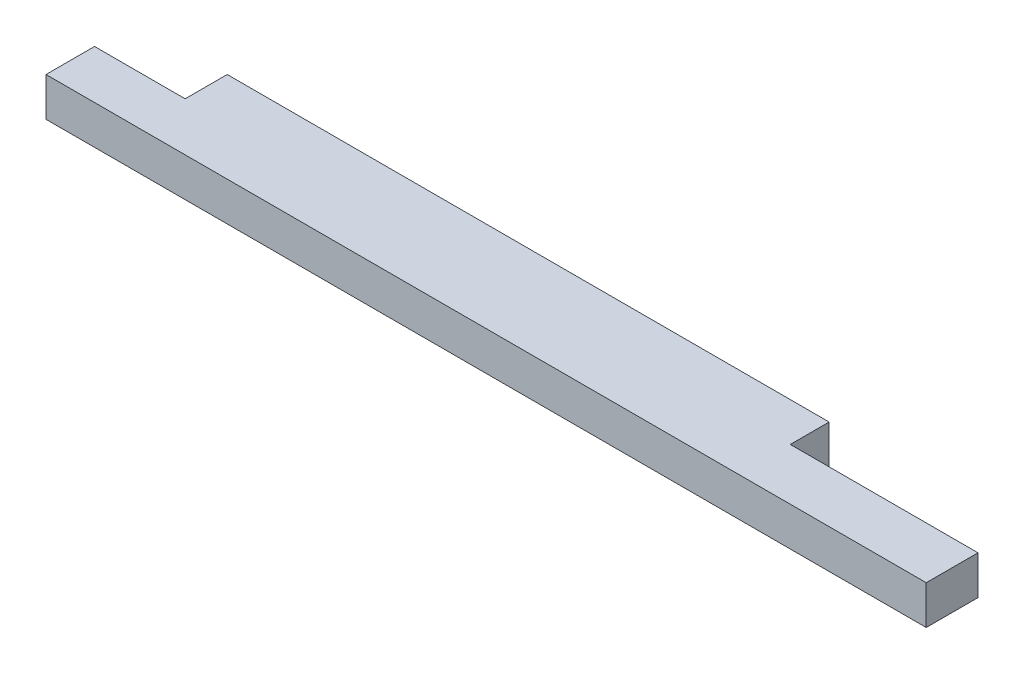
ISO-10303-21;
HEADER;
FILE_DESCRIPTION(('STEP AP214'),'2;1');
FILE_NAME('part.step','',(''),(''),'','','');
FILE_SCHEMA(('AUTOMOTIVE_DESIGN { 1 0 10303 214 1 1 1 1 }'));
ENDSEC;
DATA;
#1=APPLICATION_CONTEXT('core data for automotive mechanical design processes');
#2=APPLICATION_PROTOCOL_DEFINITION('international standard','automotive_design',2000,#1);
#3=PRODUCT_CONTEXT('',#1,'mechanical');
#4=PRODUCT('Part','Part','',(#3));
#5=PRODUCT_RELATED_PRODUCT_CATEGORY('part','',(#4));
#6=PRODUCT_DEFINITION_FORMATION('','',#4);
#7=PRODUCT_DEFINITION_CONTEXT('part definition',#1,'design');
#8=PRODUCT_DEFINITION('design','',#6,#7);
#9=PRODUCT_DEFINITION_SHAPE('','',#8);
#10=(LENGTH_UNIT() NAMED_UNIT(*) SI_UNIT(.MILLI.,.METRE.));
#11=(NAMED_UNIT(*) PLANE_ANGLE_UNIT() SI_UNIT($,.RADIAN.));
#12=(NAMED_UNIT(*) SI_UNIT($,.STERADIAN.) SOLID_ANGLE_UNIT());
#13=UNCERTAINTY_MEASURE_WITH_UNIT(LENGTH_MEASURE(1.E-05),#10,'distance_accuracy_value','');
#14=(GEOMETRIC_REPRESENTATION_CONTEXT(3) GLOBAL_UNCERTAINTY_ASSIGNED_CONTEXT((#13)) GLOBAL_UNIT_ASSIGNED_CONTEXT((#10,
#11,#12)) REPRESENTATION_CONTEXT('',''));
#15=CARTESIAN_POINT('',(0.,0.,0.));
#16=DIRECTION('',(0.,0.,1.));
#17=DIRECTION('',(1.,0.,0.));
#18=AXIS2_PLACEMENT_3D('',#15,#16,#17);
#19=CARTESIAN_POINT('',(0.,38.1,0.));
#20=DIRECTION('',(1.,0.,0.));
#21=DIRECTION('',(0.,0.,-1.));
#22=AXIS2_PLACEMENT_3D('',#19,#20,#21);
#23=PLANE('',#22);
#24=DIRECTION('',(0.,0.,1.));
#25=VECTOR('',#24,1.);
#26=CARTESIAN_POINT('',(0.,38.1,0.));
#27=LINE('',#26,#25);
#28=CARTESIAN_POINT('',(0.,38.1,-47.625));
#29=VERTEX_POINT('',#28);
#30=CARTESIAN_POINT('',(0.,38.1,0.));
#31=VERTEX_POINT('',#30);
#32=EDGE_CURVE('E117',#29,#31,#27,.T.);
#33=ORIENTED_EDGE('',*,*,#32,.F.);
#34=DIRECTION('',(0.,1.,0.));
#35=VECTOR('',#34,1.);
#36=CARTESIAN_POINT('',(0.,0.,-47.625));
#37=LINE('',#36,#35);
#38=CARTESIAN_POINT('',(0.,0.,-47.625));
#39=VERTEX_POINT('',#38);
#40=EDGE_CURVE('E105',#39,#29,#37,.T.);
#41=ORIENTED_EDGE('',*,*,#40,.F.);
#42=DIRECTION('',(0.,0.,1.));
#43=VECTOR('',#42,1.);
#44=CARTESIAN_POINT('',(0.,0.,0.));
#45=LINE('',#44,#43);
#46=CARTESIAN_POINT('',(0.,0.,0.));
#47=VERTEX_POINT('',#46);
#48=EDGE_CURVE('E115',#39,#47,#45,.T.);
#49=ORIENTED_EDGE('',*,*,#48,.T.);
#50=DIRECTION('',(0.,-1.,0.));
#51=VECTOR('',#50,1.);
#52=CARTESIAN_POINT('',(0.,38.1,0.));
#53=LINE('',#52,#51);
#54=EDGE_CURVE('E11',#31,#47,#53,.T.);
#55=ORIENTED_EDGE('',*,*,#54,.F.);
#56=EDGE_LOOP('',(#33,#41,#49,#55));
#57=FACE_BOUND('',#56,.T.);
#58=ADVANCED_FACE('F38',(#57),#23,.F.);
#59=CARTESIAN_POINT('',(0.,38.1,0.));
#60=DIRECTION('',(0.,0.,-1.));
#61=DIRECTION('',(-1.,0.,0.));
#62=AXIS2_PLACEMENT_3D('',#59,#60,#61);
#63=PLANE('',#62);
#64=DIRECTION('',(1.,0.,0.));
#65=VECTOR('',#64,1.);
#66=CARTESIAN_POINT('',(0.,0.,0.));
#67=LINE('',#66,#65);
#68=CARTESIAN_POINT('',(863.6,0.,0.));
#69=VERTEX_POINT('',#68);
#70=EDGE_CURVE('E121',#47,#69,#67,.T.);
#71=ORIENTED_EDGE('',*,*,#70,.T.);
#72=DIRECTION('',(0.,-1.,0.));
#73=VECTOR('',#72,1.);
#74=CARTESIAN_POINT('',(863.6,38.1,0.));
#75=LINE('',#74,#73);
#76=CARTESIAN_POINT('',(863.6,38.1,0.));
#77=VERTEX_POINT('',#76);
#78=EDGE_CURVE('E45',#77,#69,#75,.T.);
#79=ORIENTED_EDGE('',*,*,#78,.F.);
#80=DIRECTION('',(1.,0.,0.));
#81=VECTOR('',#80,1.);
#82=CARTESIAN_POINT('',(0.,38.1,0.));
#83=LINE('',#82,#81);
#84=EDGE_CURVE('E148',#31,#77,#83,.T.);
#85=ORIENTED_EDGE('',*,*,#84,.F.);
#86=ORIENTED_EDGE('',*,*,#54,.T.);
#87=EDGE_LOOP('',(#71,#79,#85,#86));
#88=FACE_BOUND('',#87,.T.);
#89=ADVANCED_FACE('F182',(#88),#63,.F.);
#90=CARTESIAN_POINT('',(863.6,38.1,0.));
#91=DIRECTION('',(-1.,0.,0.));
#92=DIRECTION('',(0.,0.,1.));
#93=AXIS2_PLACEMENT_3D('',#90,#91,#92);
#94=PLANE('',#93);
#95=DIRECTION('',(0.,0.,-1.));
#96=VECTOR('',#95,1.);
#97=CARTESIAN_POINT('',(863.6,0.,0.));
#98=LINE('',#97,#96);
#99=CARTESIAN_POINT('',(863.6,0.,-50.8));
#100=VERTEX_POINT('',#99);
#101=EDGE_CURVE('E124',#69,#100,#98,.T.);
#102=ORIENTED_EDGE('',*,*,#101,.T.);
#103=DIRECTION('',(0.,1.,0.));
#104=VECTOR('',#103,1.);
#105=CARTESIAN_POINT('',(863.6,0.,-50.8));
#106=LINE('',#105,#104);
#107=CARTESIAN_POINT('',(863.6,38.1,-50.8));
#108=VERTEX_POINT('',#107);
#109=EDGE_CURVE('E122',#100,#108,#106,.T.);
#110=ORIENTED_EDGE('',*,*,#109,.T.);
#111=DIRECTION('',(0.,0.,-1.));
#112=VECTOR('',#111,1.);
#113=CARTESIAN_POINT('',(863.6,38.1,0.));
#114=LINE('',#113,#112);
#115=EDGE_CURVE('E142',#77,#108,#114,.T.);
#116=ORIENTED_EDGE('',*,*,#115,.F.);
#117=ORIENTED_EDGE('',*,*,#78,.T.);
#118=EDGE_LOOP('',(#102,#110,#116,#117));
#119=FACE_BOUND('',#118,.T.);
#120=ADVANCED_FACE('F180',(#119),#94,.F.);
#121=CARTESIAN_POINT('',(0.,38.1,-88.9));
#122=DIRECTION('',(0.,0.,1.));
#123=DIRECTION('',(1.,0.,0.));
#124=AXIS2_PLACEMENT_3D('',#121,#122,#123);
#125=PLANE('',#124);
#126=DIRECTION('',(-1.,0.,0.));
#127=VECTOR('',#126,1.);
#128=CARTESIAN_POINT('',(0.,0.,-88.9));
#129=LINE('',#128,#127);
#130=CARTESIAN_POINT('',(679.45,0.,-88.8999999999999));
#131=VERTEX_POINT('',#130);
#132=CARTESIAN_POINT('',(88.9,0.,-88.9));
#133=VERTEX_POINT('',#132);
#134=EDGE_CURVE('E135',#131,#133,#129,.T.);
#135=ORIENTED_EDGE('',*,*,#134,.T.);
#136=DIRECTION('',(0.,1.,0.));
#137=VECTOR('',#136,1.);
#138=CARTESIAN_POINT('',(88.9,0.,-88.9));
#139=LINE('',#138,#137);
#140=CARTESIAN_POINT('',(88.9,38.1,-88.9));
#141=VERTEX_POINT('',#140);
#142=EDGE_CURVE('E162',#133,#141,#139,.T.);
#143=ORIENTED_EDGE('',*,*,#142,.T.);
#144=DIRECTION('',(-1.,0.,0.));
#145=VECTOR('',#144,1.);
#146=CARTESIAN_POINT('',(0.,38.1,-88.9));
#147=LINE('',#146,#145);
#148=CARTESIAN_POINT('',(679.45,38.1,-88.8999999999999));
#149=VERTEX_POINT('',#148);
#150=EDGE_CURVE('E130',#149,#141,#147,.T.);
#151=ORIENTED_EDGE('',*,*,#150,.F.);
#152=DIRECTION('',(0.,1.,0.));
#153=VECTOR('',#152,1.);
#154=CARTESIAN_POINT('',(679.45,0.,-88.8999999999999));
#155=LINE('',#154,#153);
#156=EDGE_CURVE('E153',#131,#149,#155,.T.);
#157=ORIENTED_EDGE('',*,*,#156,.F.);
#158=EDGE_LOOP('',(#135,#143,#151,#157));
#159=FACE_BOUND('',#158,.T.);
#160=ADVANCED_FACE('F175',(#159),#125,.F.);
#161=CARTESIAN_POINT('',(0.,38.1,0.));
#162=DIRECTION('',(0.,-1.,0.));
#163=DIRECTION('',(0.,0.,-1.));
#164=AXIS2_PLACEMENT_3D('',#161,#162,#163);
#165=PLANE('',#164);
#166=ORIENTED_EDGE('',*,*,#150,.T.);
#167=DIRECTION('',(0.,0.,-1.));
#168=VECTOR('',#167,1.);
#169=CARTESIAN_POINT('',(88.9,38.1,-88.9));
#170=LINE('',#169,#168);
#171=CARTESIAN_POINT('',(88.9,38.1,-47.625));
#172=VERTEX_POINT('',#171);
#173=EDGE_CURVE('E110',#172,#141,#170,.T.);
#174=ORIENTED_EDGE('',*,*,#173,.F.);
#175=DIRECTION('',(1.,0.,0.));
#176=VECTOR('',#175,1.);
#177=CARTESIAN_POINT('',(0.,38.1,-47.625));
#178=LINE('',#177,#176);
#179=EDGE_CURVE('E170',#29,#172,#178,.T.);
#180=ORIENTED_EDGE('',*,*,#179,.F.);
#181=ORIENTED_EDGE('',*,*,#32,.T.);
#182=ORIENTED_EDGE('',*,*,#84,.T.);
#183=ORIENTED_EDGE('',*,*,#115,.T.);
#184=DIRECTION('',(1.,0.,0.));
#185=VECTOR('',#184,1.);
#186=CARTESIAN_POINT('',(863.6,38.1,-50.8));
#187=LINE('',#186,#185);
#188=CARTESIAN_POINT('',(679.45,38.1,-50.8));
#189=VERTEX_POINT('',#188);
#190=EDGE_CURVE('E156',#189,#108,#187,.T.);
#191=ORIENTED_EDGE('',*,*,#190,.F.);
#192=DIRECTION('',(0.,0.,1.));
#193=VECTOR('',#192,1.);
#194=CARTESIAN_POINT('',(679.45,38.1,-88.8999999999999));
#195=LINE('',#194,#193);
#196=EDGE_CURVE('E159',#149,#189,#195,.T.);
#197=ORIENTED_EDGE('',*,*,#196,.F.);
#198=EDGE_LOOP('',(#166,#174,#180,#181,#182,#183,#191,#197));
#199=FACE_BOUND('',#198,.T.);
#200=ADVANCED_FACE('F178',(#199),#165,.F.);
#201=CARTESIAN_POINT('',(0.,0.,0.));
#202=DIRECTION('',(0.,-1.,0.));
#203=DIRECTION('',(0.,0.,-1.));
#204=AXIS2_PLACEMENT_3D('',#201,#202,#203);
#205=PLANE('',#204);
#206=DIRECTION('',(0.,0.,-1.));
#207=VECTOR('',#206,1.);
#208=CARTESIAN_POINT('',(88.9,0.,-88.9));
#209=LINE('',#208,#207);
#210=CARTESIAN_POINT('',(88.9,0.,-47.625));
#211=VERTEX_POINT('',#210);
#212=EDGE_CURVE('E52',#211,#133,#209,.T.);
#213=ORIENTED_EDGE('',*,*,#212,.T.);
#214=ORIENTED_EDGE('',*,*,#134,.F.);
#215=DIRECTION('',(0.,0.,1.));
#216=VECTOR('',#215,1.);
#217=CARTESIAN_POINT('',(679.45,0.,-88.8999999999999));
#218=LINE('',#217,#216);
#219=CARTESIAN_POINT('',(679.45,0.,-50.8));
#220=VERTEX_POINT('',#219);
#221=EDGE_CURVE('E158',#131,#220,#218,.T.);
#222=ORIENTED_EDGE('',*,*,#221,.T.);
#223=DIRECTION('',(1.,0.,0.));
#224=VECTOR('',#223,1.);
#225=CARTESIAN_POINT('',(863.6,0.,-50.8));
#226=LINE('',#225,#224);
#227=EDGE_CURVE('E60',#220,#100,#226,.T.);
#228=ORIENTED_EDGE('',*,*,#227,.T.);
#229=ORIENTED_EDGE('',*,*,#101,.F.);
#230=ORIENTED_EDGE('',*,*,#70,.F.);
#231=ORIENTED_EDGE('',*,*,#48,.F.);
#232=DIRECTION('',(1.,0.,0.));
#233=VECTOR('',#232,1.);
#234=CARTESIAN_POINT('',(0.,0.,-47.625));
#235=LINE('',#234,#233);
#236=EDGE_CURVE('E101',#39,#211,#235,.T.);
#237=ORIENTED_EDGE('',*,*,#236,.T.);
#238=EDGE_LOOP('',(#213,#214,#222,#228,#229,#230,#231,#237));
#239=FACE_BOUND('',#238,.T.);
#240=ADVANCED_FACE('F119',(#239),#205,.T.);
#241=CARTESIAN_POINT('',(863.6,0.,-50.8));
#242=DIRECTION('',(0.,0.,1.));
#243=DIRECTION('',(1.,0.,0.));
#244=AXIS2_PLACEMENT_3D('',#241,#242,#243);
#245=PLANE('',#244);
#246=ORIENTED_EDGE('',*,*,#190,.T.);
#247=ORIENTED_EDGE('',*,*,#109,.F.);
#248=ORIENTED_EDGE('',*,*,#227,.F.);
#249=DIRECTION('',(0.,1.,0.));
#250=VECTOR('',#249,1.);
#251=CARTESIAN_POINT('',(679.45,0.,-50.8));
#252=LINE('',#251,#250);
#253=EDGE_CURVE('E127',#220,#189,#252,.T.);
#254=ORIENTED_EDGE('',*,*,#253,.T.);
#255=EDGE_LOOP('',(#246,#247,#248,#254));
#256=FACE_BOUND('',#255,.T.);
#257=ADVANCED_FACE('F179',(#256),#245,.F.);
#258=CARTESIAN_POINT('',(679.45,0.,-88.8999999999999));
#259=DIRECTION('',(-1.,0.,0.));
#260=DIRECTION('',(0.,0.,1.));
#261=AXIS2_PLACEMENT_3D('',#258,#259,#260);
#262=PLANE('',#261);
#263=ORIENTED_EDGE('',*,*,#196,.T.);
#264=ORIENTED_EDGE('',*,*,#253,.F.);
#265=ORIENTED_EDGE('',*,*,#221,.F.);
#266=ORIENTED_EDGE('',*,*,#156,.T.);
#267=EDGE_LOOP('',(#263,#264,#265,#266));
#268=FACE_BOUND('',#267,.T.);
#269=ADVANCED_FACE('F177',(#268),#262,.F.);
#270=CARTESIAN_POINT('',(88.9,0.,-88.9));
#271=DIRECTION('',(1.,0.,0.));
#272=DIRECTION('',(0.,0.,-1.));
#273=AXIS2_PLACEMENT_3D('',#270,#271,#272);
#274=PLANE('',#273);
#275=ORIENTED_EDGE('',*,*,#173,.T.);
#276=ORIENTED_EDGE('',*,*,#142,.F.);
#277=ORIENTED_EDGE('',*,*,#212,.F.);
#278=DIRECTION('',(0.,1.,0.));
#279=VECTOR('',#278,1.);
#280=CARTESIAN_POINT('',(88.9,0.,-47.625));
#281=LINE('',#280,#279);
#282=EDGE_CURVE('E107',#211,#172,#281,.T.);
#283=ORIENTED_EDGE('',*,*,#282,.T.);
#284=EDGE_LOOP('',(#275,#276,#277,#283));
#285=FACE_BOUND('',#284,.T.);
#286=ADVANCED_FACE('F222',(#285),#274,.F.);
#287=CARTESIAN_POINT('',(0.,0.,-47.625));
#288=DIRECTION('',(0.,0.,1.));
#289=DIRECTION('',(1.,0.,0.));
#290=AXIS2_PLACEMENT_3D('',#287,#288,#289);
#291=PLANE('',#290);
#292=ORIENTED_EDGE('',*,*,#179,.T.);
#293=ORIENTED_EDGE('',*,*,#282,.F.);
#294=ORIENTED_EDGE('',*,*,#236,.F.);
#295=ORIENTED_EDGE('',*,*,#40,.T.);
#296=EDGE_LOOP('',(#292,#293,#294,#295));
#297=FACE_BOUND('',#296,.T.);
#298=ADVANCED_FACE('F104',(#297),#291,.F.);
#299=CLOSED_SHELL('',(#58,#89,#120,#160,#200,#240,#257,#269,#286,#298));
#300=MANIFOLD_SOLID_BREP('B2',#299);
#301=ADVANCED_BREP_SHAPE_REPRESENTATION('',(#18,#300),#14);
#302=SHAPE_DEFINITION_REPRESENTATION(#9,#301);
ENDSEC;
END-ISO-10303-21;
